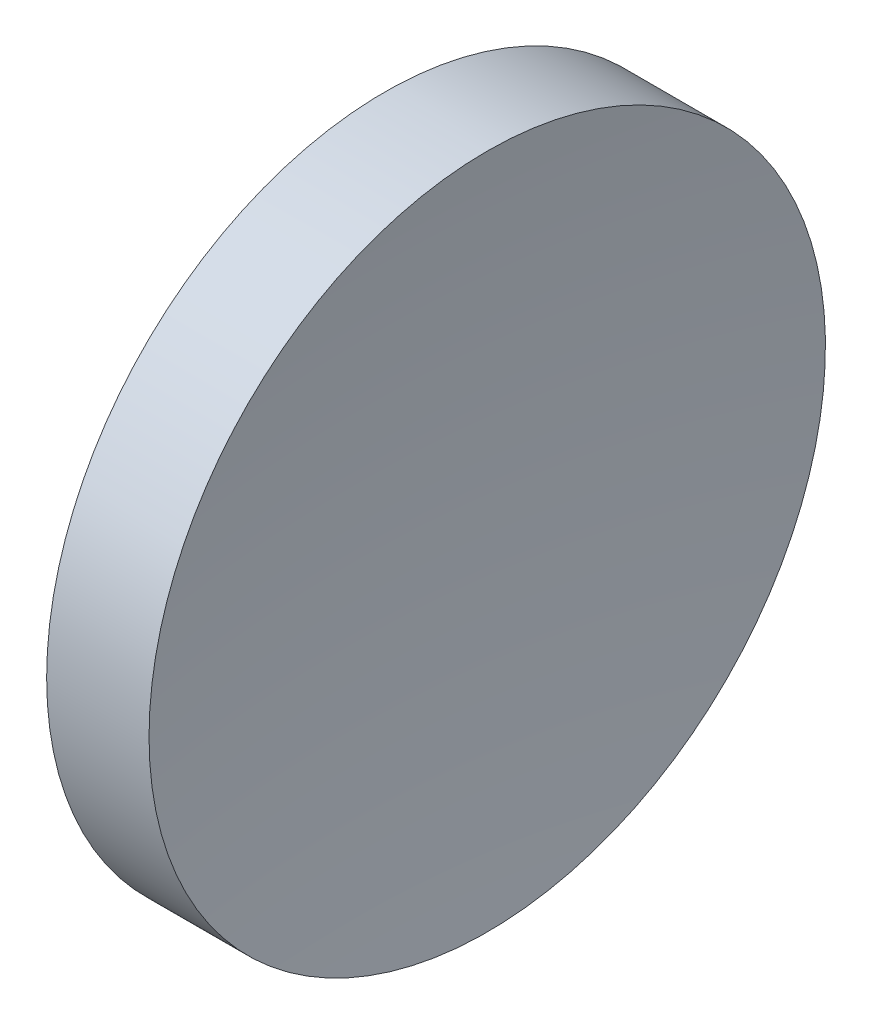
ISO-10303-21;
HEADER;
FILE_DESCRIPTION(('STEP AP214'),'2;1');
FILE_NAME('part.step','',(''),(''),'','','');
FILE_SCHEMA(('AUTOMOTIVE_DESIGN { 1 0 10303 214 1 1 1 1 }'));
ENDSEC;
DATA;
#1=APPLICATION_CONTEXT('core data for automotive mechanical design processes');
#2=APPLICATION_PROTOCOL_DEFINITION('international standard','automotive_design',2000,#1);
#3=PRODUCT_CONTEXT('',#1,'mechanical');
#4=PRODUCT('Part','Part','',(#3));
#5=PRODUCT_RELATED_PRODUCT_CATEGORY('part','',(#4));
#6=PRODUCT_DEFINITION_FORMATION('','',#4);
#7=PRODUCT_DEFINITION_CONTEXT('part definition',#1,'design');
#8=PRODUCT_DEFINITION('design','',#6,#7);
#9=PRODUCT_DEFINITION_SHAPE('','',#8);
#10=(LENGTH_UNIT() NAMED_UNIT(*) SI_UNIT(.MILLI.,.METRE.));
#11=(NAMED_UNIT(*) PLANE_ANGLE_UNIT() SI_UNIT($,.RADIAN.));
#12=(NAMED_UNIT(*) SI_UNIT($,.STERADIAN.) SOLID_ANGLE_UNIT());
#13=UNCERTAINTY_MEASURE_WITH_UNIT(LENGTH_MEASURE(1.E-05),#10,'distance_accuracy_value','');
#14=(GEOMETRIC_REPRESENTATION_CONTEXT(3) GLOBAL_UNCERTAINTY_ASSIGNED_CONTEXT((#13)) GLOBAL_UNIT_ASSIGNED_CONTEXT((#10,
#11,#12)) REPRESENTATION_CONTEXT('',''));
#15=CARTESIAN_POINT('',(0.,0.,0.));
#16=DIRECTION('',(0.,0.,1.));
#17=DIRECTION('',(1.,0.,0.));
#18=AXIS2_PLACEMENT_3D('',#15,#16,#17);
#19=CARTESIAN_POINT('',(539.199612196117,138.756042246745,0.));
#20=DIRECTION('',(-1.,0.,0.));
#21=DIRECTION('',(0.,1.,0.));
#22=AXIS2_PLACEMENT_3D('',#19,#20,#21);
#23=SPHERICAL_SURFACE('',#22,300.);
#24=CARTESIAN_POINT('',(241.552589701351,138.756042246745,0.));
#25=DIRECTION('',(-1.,0.,0.));
#26=DIRECTION('',(0.,0.,1.));
#27=AXIS2_PLACEMENT_3D('',#24,#25,#26);
#28=CIRCLE('',#27,37.5);
#29=CARTESIAN_POINT('',(241.552589701351,138.756042246745,37.5));
#30=VERTEX_POINT('',#29);
#31=EDGE_CURVE('E10',#30,#30,#28,.T.);
#32=ORIENTED_EDGE('',*,*,#31,.F.);
#33=EDGE_LOOP('',(#32));
#34=FACE_BOUND('',#33,.T.);
#35=ADVANCED_FACE('F35',(#34),#23,.F.);
#36=CARTESIAN_POINT('',(217.97028600433,138.756042246745,0.));
#37=DIRECTION('',(-1.,0.,0.));
#38=DIRECTION('',(0.,0.,1.));
#39=AXIS2_PLACEMENT_3D('',#36,#37,#38);
#40=CYLINDRICAL_SURFACE('',#39,37.5);
#41=CARTESIAN_POINT('',(230.199611905266,138.756042246745,0.));
#42=DIRECTION('',(-1.,0.,0.));
#43=DIRECTION('',(0.,0.,1.));
#44=AXIS2_PLACEMENT_3D('',#41,#42,#43);
#45=CIRCLE('',#44,37.5);
#46=CARTESIAN_POINT('',(230.199611905266,138.756042246745,37.5));
#47=VERTEX_POINT('',#46);
#48=EDGE_CURVE('E41',#47,#47,#45,.T.);
#49=ORIENTED_EDGE('',*,*,#48,.F.);
#50=EDGE_LOOP('',(#49));
#51=FACE_BOUND('',#50,.T.);
#52=ORIENTED_EDGE('',*,*,#31,.T.);
#53=EDGE_LOOP('',(#52));
#54=FACE_BOUND('',#53,.T.);
#55=ADVANCED_FACE('F49',(#51,#54),#40,.T.);
#56=CARTESIAN_POINT('',(230.199611905266,138.756042246745,0.));
#57=DIRECTION('',(1.,0.,0.));
#58=DIRECTION('',(0.,0.,-1.));
#59=AXIS2_PLACEMENT_3D('',#56,#57,#58);
#60=PLANE('',#59);
#61=ORIENTED_EDGE('',*,*,#48,.T.);
#62=EDGE_LOOP('',(#61));
#63=FACE_BOUND('',#62,.T.);
#64=ADVANCED_FACE('F47',(#63),#60,.F.);
#65=CLOSED_SHELL('',(#35,#55,#64));
#66=MANIFOLD_SOLID_BREP('B2',#65);
#67=ADVANCED_BREP_SHAPE_REPRESENTATION('',(#18,#66),#14);
#68=SHAPE_DEFINITION_REPRESENTATION(#9,#67);
ENDSEC;
END-ISO-10303-21;
